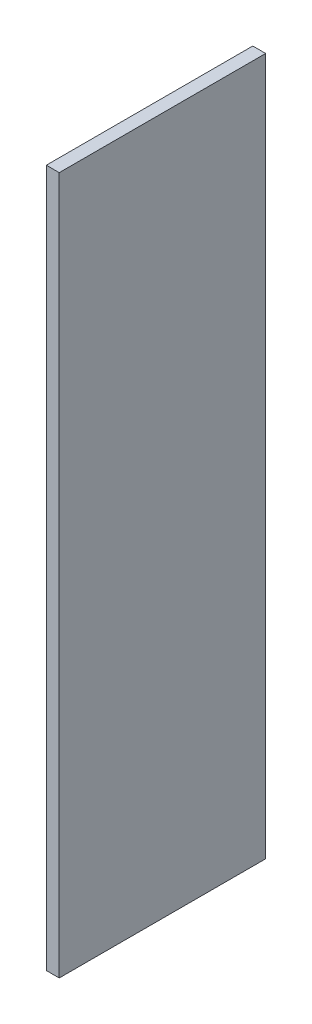
ISO-10303-21;
HEADER;
FILE_DESCRIPTION(('STEP AP214'),'2;1');
FILE_NAME('part.step','',(''),(''),'','','');
FILE_SCHEMA(('AUTOMOTIVE_DESIGN { 1 0 10303 214 1 1 1 1 }'));
ENDSEC;
DATA;
#1=APPLICATION_CONTEXT('core data for automotive mechanical design processes');
#2=APPLICATION_PROTOCOL_DEFINITION('international standard','automotive_design',2000,#1);
#3=PRODUCT_CONTEXT('',#1,'mechanical');
#4=PRODUCT('Part','Part','',(#3));
#5=PRODUCT_RELATED_PRODUCT_CATEGORY('part','',(#4));
#6=PRODUCT_DEFINITION_FORMATION('','',#4);
#7=PRODUCT_DEFINITION_CONTEXT('part definition',#1,'design');
#8=PRODUCT_DEFINITION('design','',#6,#7);
#9=PRODUCT_DEFINITION_SHAPE('','',#8);
#10=(LENGTH_UNIT() NAMED_UNIT(*) SI_UNIT(.MILLI.,.METRE.));
#11=(NAMED_UNIT(*) PLANE_ANGLE_UNIT() SI_UNIT($,.RADIAN.));
#12=(NAMED_UNIT(*) SI_UNIT($,.STERADIAN.) SOLID_ANGLE_UNIT());
#13=UNCERTAINTY_MEASURE_WITH_UNIT(LENGTH_MEASURE(1.E-05),#10,'distance_accuracy_value','');
#14=(GEOMETRIC_REPRESENTATION_CONTEXT(3) GLOBAL_UNCERTAINTY_ASSIGNED_CONTEXT((#13)) GLOBAL_UNIT_ASSIGNED_CONTEXT((#10,
#11,#12)) REPRESENTATION_CONTEXT('',''));
#15=CARTESIAN_POINT('',(0.,0.,0.));
#16=DIRECTION('',(0.,0.,1.));
#17=DIRECTION('',(1.,0.,0.));
#18=AXIS2_PLACEMENT_3D('',#15,#16,#17);
#19=CARTESIAN_POINT('',(18.,-915.219556499024,267.607933188847));
#20=DIRECTION('',(0.,0.,-1.));
#21=DIRECTION('',(-1.,0.,0.));
#22=AXIS2_PLACEMENT_3D('',#19,#20,#21);
#23=PLANE('',#22);
#24=DIRECTION('',(0.,-1.,0.));
#25=VECTOR('',#24,1.);
#26=CARTESIAN_POINT('',(0.,-915.219556499024,267.607933188847));
#27=LINE('',#26,#25);
#28=CARTESIAN_POINT('',(0.,57.7804435009756,267.607933188847));
#29=VERTEX_POINT('',#28);
#30=CARTESIAN_POINT('',(0.,-915.219556499024,267.607933188847));
#31=VERTEX_POINT('',#30);
#32=EDGE_CURVE('E96',#29,#31,#27,.T.);
#33=ORIENTED_EDGE('',*,*,#32,.T.);
#34=DIRECTION('',(-1.,0.,0.));
#35=VECTOR('',#34,1.);
#36=CARTESIAN_POINT('',(18.,-915.219556499024,267.607933188847));
#37=LINE('',#36,#35);
#38=CARTESIAN_POINT('',(18.,-915.219556499024,267.607933188847));
#39=VERTEX_POINT('',#38);
#40=EDGE_CURVE('E11',#39,#31,#37,.T.);
#41=ORIENTED_EDGE('',*,*,#40,.F.);
#42=DIRECTION('',(0.,-1.,0.));
#43=VECTOR('',#42,1.);
#44=CARTESIAN_POINT('',(18.,-915.219556499024,267.607933188847));
#45=LINE('',#44,#43);
#46=CARTESIAN_POINT('',(18.,57.7804435009756,267.607933188847));
#47=VERTEX_POINT('',#46);
#48=EDGE_CURVE('E84',#47,#39,#45,.T.);
#49=ORIENTED_EDGE('',*,*,#48,.F.);
#50=DIRECTION('',(-1.,0.,0.));
#51=VECTOR('',#50,1.);
#52=CARTESIAN_POINT('',(18.,57.7804435009756,267.607933188847));
#53=LINE('',#52,#51);
#54=EDGE_CURVE('E92',#47,#29,#53,.T.);
#55=ORIENTED_EDGE('',*,*,#54,.T.);
#56=EDGE_LOOP('',(#33,#41,#49,#55));
#57=FACE_BOUND('',#56,.T.);
#58=ADVANCED_FACE('F33',(#57),#23,.F.);
#59=CARTESIAN_POINT('',(18.,-915.219556499024,-20.392066811153));
#60=DIRECTION('',(0.,1.,0.));
#61=DIRECTION('',(0.,0.,1.));
#62=AXIS2_PLACEMENT_3D('',#59,#60,#61);
#63=PLANE('',#62);
#64=DIRECTION('',(0.,0.,-1.));
#65=VECTOR('',#64,1.);
#66=CARTESIAN_POINT('',(0.,-915.219556499024,-20.392066811153));
#67=LINE('',#66,#65);
#68=CARTESIAN_POINT('',(0.,-915.219556499024,-20.392066811153));
#69=VERTEX_POINT('',#68);
#70=EDGE_CURVE('E88',#31,#69,#67,.T.);
#71=ORIENTED_EDGE('',*,*,#70,.T.);
#72=DIRECTION('',(-1.,0.,0.));
#73=VECTOR('',#72,1.);
#74=CARTESIAN_POINT('',(18.,-915.219556499024,-20.392066811153));
#75=LINE('',#74,#73);
#76=CARTESIAN_POINT('',(18.,-915.219556499024,-20.392066811153));
#77=VERTEX_POINT('',#76);
#78=EDGE_CURVE('E41',#77,#69,#75,.T.);
#79=ORIENTED_EDGE('',*,*,#78,.F.);
#80=DIRECTION('',(0.,0.,-1.));
#81=VECTOR('',#80,1.);
#82=CARTESIAN_POINT('',(18.,-915.219556499024,-20.392066811153));
#83=LINE('',#82,#81);
#84=EDGE_CURVE('E79',#39,#77,#83,.T.);
#85=ORIENTED_EDGE('',*,*,#84,.F.);
#86=ORIENTED_EDGE('',*,*,#40,.T.);
#87=EDGE_LOOP('',(#71,#79,#85,#86));
#88=FACE_BOUND('',#87,.T.);
#89=ADVANCED_FACE('F87',(#88),#63,.F.);
#90=CARTESIAN_POINT('',(18.,-915.219556499024,-20.392066811153));
#91=DIRECTION('',(0.,0.,1.));
#92=DIRECTION('',(1.,0.,0.));
#93=AXIS2_PLACEMENT_3D('',#90,#91,#92);
#94=PLANE('',#93);
#95=DIRECTION('',(0.,1.,0.));
#96=VECTOR('',#95,1.);
#97=CARTESIAN_POINT('',(0.,-915.219556499024,-20.392066811153));
#98=LINE('',#97,#96);
#99=CARTESIAN_POINT('',(0.,57.7804435009756,-20.392066811153));
#100=VERTEX_POINT('',#99);
#101=EDGE_CURVE('E66',#69,#100,#98,.T.);
#102=ORIENTED_EDGE('',*,*,#101,.T.);
#103=DIRECTION('',(-1.,0.,0.));
#104=VECTOR('',#103,1.);
#105=CARTESIAN_POINT('',(18.,57.7804435009756,-20.392066811153));
#106=LINE('',#105,#104);
#107=CARTESIAN_POINT('',(18.,57.7804435009756,-20.392066811153));
#108=VERTEX_POINT('',#107);
#109=EDGE_CURVE('E89',#108,#100,#106,.T.);
#110=ORIENTED_EDGE('',*,*,#109,.F.);
#111=DIRECTION('',(0.,1.,0.));
#112=VECTOR('',#111,1.);
#113=CARTESIAN_POINT('',(18.,-915.219556499024,-20.392066811153));
#114=LINE('',#113,#112);
#115=EDGE_CURVE('E82',#77,#108,#114,.T.);
#116=ORIENTED_EDGE('',*,*,#115,.F.);
#117=ORIENTED_EDGE('',*,*,#78,.T.);
#118=EDGE_LOOP('',(#102,#110,#116,#117));
#119=FACE_BOUND('',#118,.T.);
#120=ADVANCED_FACE('F90',(#119),#94,.F.);
#121=CARTESIAN_POINT('',(18.,57.7804435009756,-20.392066811153));
#122=DIRECTION('',(0.,-1.,0.));
#123=DIRECTION('',(0.,0.,-1.));
#124=AXIS2_PLACEMENT_3D('',#121,#122,#123);
#125=PLANE('',#124);
#126=DIRECTION('',(0.,0.,1.));
#127=VECTOR('',#126,1.);
#128=CARTESIAN_POINT('',(0.,57.7804435009756,-20.392066811153));
#129=LINE('',#128,#127);
#130=EDGE_CURVE('E72',#100,#29,#129,.T.);
#131=ORIENTED_EDGE('',*,*,#130,.T.);
#132=ORIENTED_EDGE('',*,*,#54,.F.);
#133=DIRECTION('',(0.,0.,1.));
#134=VECTOR('',#133,1.);
#135=CARTESIAN_POINT('',(18.,57.7804435009756,-20.392066811153));
#136=LINE('',#135,#134);
#137=EDGE_CURVE('E49',#108,#47,#136,.T.);
#138=ORIENTED_EDGE('',*,*,#137,.F.);
#139=ORIENTED_EDGE('',*,*,#109,.T.);
#140=EDGE_LOOP('',(#131,#132,#138,#139));
#141=FACE_BOUND('',#140,.T.);
#142=ADVANCED_FACE('F103',(#141),#125,.F.);
#143=CARTESIAN_POINT('',(18.,0.,0.));
#144=DIRECTION('',(1.,0.,0.));
#145=DIRECTION('',(0.,0.,-1.));
#146=AXIS2_PLACEMENT_3D('',#143,#144,#145);
#147=PLANE('',#146);
#148=ORIENTED_EDGE('',*,*,#48,.T.);
#149=ORIENTED_EDGE('',*,*,#84,.T.);
#150=ORIENTED_EDGE('',*,*,#115,.T.);
#151=ORIENTED_EDGE('',*,*,#137,.T.);
#152=EDGE_LOOP('',(#148,#149,#150,#151));
#153=FACE_BOUND('',#152,.T.);
#154=ADVANCED_FACE('F80',(#153),#147,.T.);
#155=CARTESIAN_POINT('',(0.,0.,0.));
#156=DIRECTION('',(1.,0.,0.));
#157=DIRECTION('',(0.,0.,-1.));
#158=AXIS2_PLACEMENT_3D('',#155,#156,#157);
#159=PLANE('',#158);
#160=ORIENTED_EDGE('',*,*,#32,.F.);
#161=ORIENTED_EDGE('',*,*,#130,.F.);
#162=ORIENTED_EDGE('',*,*,#101,.F.);
#163=ORIENTED_EDGE('',*,*,#70,.F.);
#164=EDGE_LOOP('',(#160,#161,#162,#163));
#165=FACE_BOUND('',#164,.T.);
#166=ADVANCED_FACE('F106',(#165),#159,.F.);
#167=CLOSED_SHELL('',(#58,#89,#120,#142,#154,#166));
#168=MANIFOLD_SOLID_BREP('B2',#167);
#169=ADVANCED_BREP_SHAPE_REPRESENTATION('',(#18,#168),#14);
#170=SHAPE_DEFINITION_REPRESENTATION(#9,#169);
ENDSEC;
END-ISO-10303-21;
